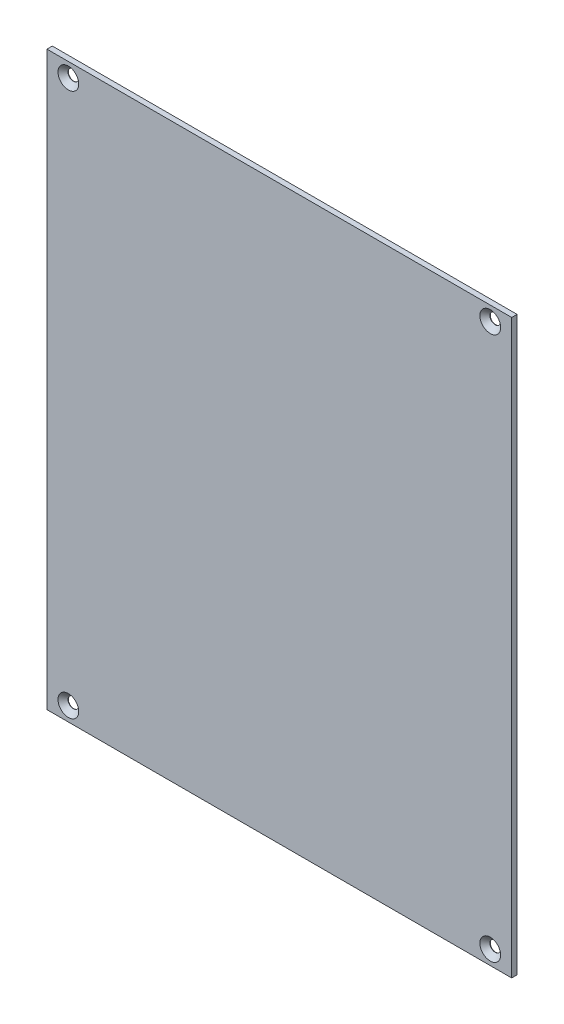
ISO-10303-21;
HEADER;
FILE_DESCRIPTION(('STEP AP214'),'2;1');
FILE_NAME('part.step','',(''),(''),'','','');
FILE_SCHEMA(('AUTOMOTIVE_DESIGN { 1 0 10303 214 1 1 1 1 }'));
ENDSEC;
DATA;
#1=APPLICATION_CONTEXT('core data for automotive mechanical design processes');
#2=APPLICATION_PROTOCOL_DEFINITION('international standard','automotive_design',2000,#1);
#3=PRODUCT_CONTEXT('',#1,'mechanical');
#4=PRODUCT('Part','Part','',(#3));
#5=PRODUCT_RELATED_PRODUCT_CATEGORY('part','',(#4));
#6=PRODUCT_DEFINITION_FORMATION('','',#4);
#7=PRODUCT_DEFINITION_CONTEXT('part definition',#1,'design');
#8=PRODUCT_DEFINITION('design','',#6,#7);
#9=PRODUCT_DEFINITION_SHAPE('','',#8);
#10=(LENGTH_UNIT() NAMED_UNIT(*) SI_UNIT(.MILLI.,.METRE.));
#11=(NAMED_UNIT(*) PLANE_ANGLE_UNIT() SI_UNIT($,.RADIAN.));
#12=(NAMED_UNIT(*) SI_UNIT($,.STERADIAN.) SOLID_ANGLE_UNIT());
#13=UNCERTAINTY_MEASURE_WITH_UNIT(LENGTH_MEASURE(1.E-05),#10,'distance_accuracy_value','');
#14=(GEOMETRIC_REPRESENTATION_CONTEXT(3) GLOBAL_UNCERTAINTY_ASSIGNED_CONTEXT((#13)) GLOBAL_UNIT_ASSIGNED_CONTEXT((#10,
#11,#12)) REPRESENTATION_CONTEXT('',''));
#15=CARTESIAN_POINT('',(0.,0.,0.));
#16=DIRECTION('',(0.,0.,1.));
#17=DIRECTION('',(1.,0.,0.));
#18=AXIS2_PLACEMENT_3D('',#15,#16,#17);
#19=CARTESIAN_POINT('',(0.,0.,0.));
#20=DIRECTION('',(0.,0.,1.));
#21=DIRECTION('',(1.,0.,0.));
#22=AXIS2_PLACEMENT_3D('',#19,#20,#21);
#23=PLANE('',#22);
#24=CARTESIAN_POINT('',(-59.,76.,0.));
#25=DIRECTION('',(0.,0.,-1.));
#26=DIRECTION('',(1.,0.,0.));
#27=AXIS2_PLACEMENT_3D('',#24,#25,#26);
#28=CIRCLE('',#27,1.5);
#29=CARTESIAN_POINT('',(-60.5,76.,0.));
#30=VERTEX_POINT('',#29);
#31=EDGE_CURVE('E202',#30,#30,#28,.T.);
#32=ORIENTED_EDGE('',*,*,#31,.F.);
#33=EDGE_LOOP('',(#32));
#34=FACE_BOUND('',#33,.T.);
#35=CARTESIAN_POINT('',(-59.,-76.,0.));
#36=DIRECTION('',(0.,0.,-1.));
#37=DIRECTION('',(1.,0.,0.));
#38=AXIS2_PLACEMENT_3D('',#35,#36,#37);
#39=CIRCLE('',#38,1.5);
#40=CARTESIAN_POINT('',(-60.5,-76.,0.));
#41=VERTEX_POINT('',#40);
#42=EDGE_CURVE('E181',#41,#41,#39,.T.);
#43=ORIENTED_EDGE('',*,*,#42,.F.);
#44=EDGE_LOOP('',(#43));
#45=FACE_BOUND('',#44,.T.);
#46=CARTESIAN_POINT('',(59.,-76.,0.));
#47=DIRECTION('',(0.,0.,-1.));
#48=DIRECTION('',(1.,0.,0.));
#49=AXIS2_PLACEMENT_3D('',#46,#47,#48);
#50=CIRCLE('',#49,1.5);
#51=CARTESIAN_POINT('',(57.5,-76.,0.));
#52=VERTEX_POINT('',#51);
#53=EDGE_CURVE('E215',#52,#52,#50,.T.);
#54=ORIENTED_EDGE('',*,*,#53,.F.);
#55=EDGE_LOOP('',(#54));
#56=FACE_BOUND('',#55,.T.);
#57=CARTESIAN_POINT('',(59.,76.,0.));
#58=DIRECTION('',(0.,0.,-1.));
#59=DIRECTION('',(1.,0.,0.));
#60=AXIS2_PLACEMENT_3D('',#57,#58,#59);
#61=CIRCLE('',#60,1.5);
#62=CARTESIAN_POINT('',(57.5,76.,0.));
#63=VERTEX_POINT('',#62);
#64=EDGE_CURVE('E198',#63,#63,#61,.T.);
#65=ORIENTED_EDGE('',*,*,#64,.F.);
#66=EDGE_LOOP('',(#65));
#67=FACE_BOUND('',#66,.T.);
#68=DIRECTION('',(0.,1.,0.));
#69=VECTOR('',#68,1.);
#70=CARTESIAN_POINT('',(65.,-80.,0.));
#71=LINE('',#70,#69);
#72=CARTESIAN_POINT('',(65.,-80.,0.));
#73=VERTEX_POINT('',#72);
#74=CARTESIAN_POINT('',(65.,80.,0.));
#75=VERTEX_POINT('',#74);
#76=EDGE_CURVE('E11',#73,#75,#71,.T.);
#77=ORIENTED_EDGE('',*,*,#76,.F.);
#78=DIRECTION('',(1.,0.,0.));
#79=VECTOR('',#78,1.);
#80=CARTESIAN_POINT('',(-65.,-80.,0.));
#81=LINE('',#80,#79);
#82=CARTESIAN_POINT('',(-65.,-80.,0.));
#83=VERTEX_POINT('',#82);
#84=EDGE_CURVE('E221',#83,#73,#81,.T.);
#85=ORIENTED_EDGE('',*,*,#84,.F.);
#86=DIRECTION('',(0.,-1.,0.));
#87=VECTOR('',#86,1.);
#88=CARTESIAN_POINT('',(-65.,80.,0.));
#89=LINE('',#88,#87);
#90=CARTESIAN_POINT('',(-65.,80.,0.));
#91=VERTEX_POINT('',#90);
#92=EDGE_CURVE('E128',#91,#83,#89,.T.);
#93=ORIENTED_EDGE('',*,*,#92,.F.);
#94=DIRECTION('',(-1.,0.,0.));
#95=VECTOR('',#94,1.);
#96=CARTESIAN_POINT('',(65.,80.,0.));
#97=LINE('',#96,#95);
#98=EDGE_CURVE('E170',#75,#91,#97,.T.);
#99=ORIENTED_EDGE('',*,*,#98,.F.);
#100=EDGE_LOOP('',(#77,#85,#93,#99));
#101=FACE_BOUND('',#100,.T.);
#102=ADVANCED_FACE('F16',(#34,#45,#56,#67,#101),#23,.F.);
#103=CARTESIAN_POINT('',(65.,-80.,0.));
#104=DIRECTION('',(1.,0.,0.));
#105=DIRECTION('',(0.,1.,0.));
#106=AXIS2_PLACEMENT_3D('',#103,#104,#105);
#107=PLANE('',#106);
#108=ORIENTED_EDGE('',*,*,#76,.T.);
#109=DIRECTION('',(0.,0.,1.));
#110=VECTOR('',#109,1.);
#111=CARTESIAN_POINT('',(65.,80.,0.));
#112=LINE('',#111,#110);
#113=CARTESIAN_POINT('',(65.,80.,1.5));
#114=VERTEX_POINT('',#113);
#115=EDGE_CURVE('E27',#75,#114,#112,.T.);
#116=ORIENTED_EDGE('',*,*,#115,.T.);
#117=DIRECTION('',(0.,1.,0.));
#118=VECTOR('',#117,1.);
#119=CARTESIAN_POINT('',(65.,-80.,1.5));
#120=LINE('',#119,#118);
#121=CARTESIAN_POINT('',(65.,-80.,1.5));
#122=VERTEX_POINT('',#121);
#123=EDGE_CURVE('E149',#122,#114,#120,.T.);
#124=ORIENTED_EDGE('',*,*,#123,.F.);
#125=DIRECTION('',(0.,0.,1.));
#126=VECTOR('',#125,1.);
#127=CARTESIAN_POINT('',(65.,-80.,0.));
#128=LINE('',#127,#126);
#129=EDGE_CURVE('E20',#73,#122,#128,.T.);
#130=ORIENTED_EDGE('',*,*,#129,.F.);
#131=EDGE_LOOP('',(#108,#116,#124,#130));
#132=FACE_BOUND('',#131,.T.);
#133=ADVANCED_FACE('F270',(#132),#107,.T.);
#134=CARTESIAN_POINT('',(65.,80.,0.));
#135=DIRECTION('',(0.,1.,0.));
#136=DIRECTION('',(1.,0.,0.));
#137=AXIS2_PLACEMENT_3D('',#134,#135,#136);
#138=PLANE('',#137);
#139=ORIENTED_EDGE('',*,*,#98,.T.);
#140=DIRECTION('',(0.,0.,1.));
#141=VECTOR('',#140,1.);
#142=CARTESIAN_POINT('',(-65.,80.,0.));
#143=LINE('',#142,#141);
#144=CARTESIAN_POINT('',(-65.,80.,1.5));
#145=VERTEX_POINT('',#144);
#146=EDGE_CURVE('E156',#91,#145,#143,.T.);
#147=ORIENTED_EDGE('',*,*,#146,.T.);
#148=DIRECTION('',(-1.,0.,0.));
#149=VECTOR('',#148,1.);
#150=CARTESIAN_POINT('',(65.,80.,1.5));
#151=LINE('',#150,#149);
#152=EDGE_CURVE('E142',#114,#145,#151,.T.);
#153=ORIENTED_EDGE('',*,*,#152,.F.);
#154=ORIENTED_EDGE('',*,*,#115,.F.);
#155=EDGE_LOOP('',(#139,#147,#153,#154));
#156=FACE_BOUND('',#155,.T.);
#157=ADVANCED_FACE('F278',(#156),#138,.T.);
#158=CARTESIAN_POINT('',(-65.,80.,0.));
#159=DIRECTION('',(-1.,0.,0.));
#160=DIRECTION('',(0.,0.,1.));
#161=AXIS2_PLACEMENT_3D('',#158,#159,#160);
#162=PLANE('',#161);
#163=ORIENTED_EDGE('',*,*,#92,.T.);
#164=DIRECTION('',(0.,0.,1.));
#165=VECTOR('',#164,1.);
#166=CARTESIAN_POINT('',(-65.,-80.,0.));
#167=LINE('',#166,#165);
#168=CARTESIAN_POINT('',(-65.,-80.,1.5));
#169=VERTEX_POINT('',#168);
#170=EDGE_CURVE('E121',#83,#169,#167,.T.);
#171=ORIENTED_EDGE('',*,*,#170,.T.);
#172=DIRECTION('',(0.,-1.,0.));
#173=VECTOR('',#172,1.);
#174=CARTESIAN_POINT('',(-65.,80.,1.5));
#175=LINE('',#174,#173);
#176=EDGE_CURVE('E125',#145,#169,#175,.T.);
#177=ORIENTED_EDGE('',*,*,#176,.F.);
#178=ORIENTED_EDGE('',*,*,#146,.F.);
#179=EDGE_LOOP('',(#163,#171,#177,#178));
#180=FACE_BOUND('',#179,.T.);
#181=ADVANCED_FACE('F122',(#180),#162,.T.);
#182=CARTESIAN_POINT('',(-65.,-80.,0.));
#183=DIRECTION('',(0.,-1.,0.));
#184=DIRECTION('',(0.,0.,-1.));
#185=AXIS2_PLACEMENT_3D('',#182,#183,#184);
#186=PLANE('',#185);
#187=ORIENTED_EDGE('',*,*,#84,.T.);
#188=ORIENTED_EDGE('',*,*,#129,.T.);
#189=DIRECTION('',(1.,0.,0.));
#190=VECTOR('',#189,1.);
#191=CARTESIAN_POINT('',(-65.,-80.,1.5));
#192=LINE('',#191,#190);
#193=EDGE_CURVE('E132',#169,#122,#192,.T.);
#194=ORIENTED_EDGE('',*,*,#193,.F.);
#195=ORIENTED_EDGE('',*,*,#170,.F.);
#196=EDGE_LOOP('',(#187,#188,#194,#195));
#197=FACE_BOUND('',#196,.T.);
#198=ADVANCED_FACE('F133',(#197),#186,.T.);
#199=CARTESIAN_POINT('',(-59.,76.,0.));
#200=DIRECTION('',(0.,0.,1.));
#201=DIRECTION('',(1.,0.,0.));
#202=AXIS2_PLACEMENT_3D('',#199,#200,#201);
#203=CYLINDRICAL_SURFACE('',#202,1.5);
#204=CARTESIAN_POINT('',(-59.,76.,0.1));
#205=DIRECTION('',(0.,0.,-1.));
#206=DIRECTION('',(1.,0.,0.));
#207=AXIS2_PLACEMENT_3D('',#204,#205,#206);
#208=CIRCLE('',#207,1.5);
#209=CARTESIAN_POINT('',(-60.5,76.,0.1));
#210=VERTEX_POINT('',#209);
#211=EDGE_CURVE('E157',#210,#210,#208,.T.);
#212=ORIENTED_EDGE('',*,*,#211,.F.);
#213=DIRECTION('',(0.,0.,-1.));
#214=VECTOR('',#213,1.);
#215=CARTESIAN_POINT('',(-60.5,76.,0.));
#216=LINE('',#215,#214);
#217=EDGE_CURVE('E161',#210,#30,#216,.T.);
#218=ORIENTED_EDGE('',*,*,#217,.T.);
#219=ORIENTED_EDGE('',*,*,#31,.T.);
#220=ORIENTED_EDGE('',*,*,#217,.F.);
#221=EDGE_LOOP('',(#212,#218,#219,#220));
#222=FACE_BOUND('',#221,.T.);
#223=ADVANCED_FACE('F289',(#222),#203,.F.);
#224=CARTESIAN_POINT('',(-59.,76.,0.8));
#225=DIRECTION('',(0.,0.,1.));
#226=DIRECTION('',(1.,0.,0.));
#227=AXIS2_PLACEMENT_3D('',#224,#225,#226);
#228=CONICAL_SURFACE('',#227,2.2,0.785398163397447);
#229=CARTESIAN_POINT('',(-59.,76.,1.5));
#230=DIRECTION('',(0.,0.,1.));
#231=DIRECTION('',(1.,0.,0.));
#232=AXIS2_PLACEMENT_3D('',#229,#230,#231);
#233=CIRCLE('',#232,2.9);
#234=CARTESIAN_POINT('',(-61.9,76.,1.5));
#235=VERTEX_POINT('',#234);
#236=EDGE_CURVE('E180',#235,#235,#233,.T.);
#237=ORIENTED_EDGE('',*,*,#236,.T.);
#238=DIRECTION('',(0.707106781186547,0.,-0.707106781186548));
#239=VECTOR('',#238,1.);
#240=CARTESIAN_POINT('',(-61.2,76.,0.8));
#241=LINE('',#240,#239);
#242=EDGE_CURVE('E152',#235,#210,#241,.T.);
#243=ORIENTED_EDGE('',*,*,#242,.T.);
#244=ORIENTED_EDGE('',*,*,#211,.T.);
#245=ORIENTED_EDGE('',*,*,#242,.F.);
#246=EDGE_LOOP('',(#237,#243,#244,#245));
#247=FACE_BOUND('',#246,.T.);
#248=ADVANCED_FACE('F251',(#247),#228,.F.);
#249=CARTESIAN_POINT('',(59.,76.,0.));
#250=DIRECTION('',(0.,0.,1.));
#251=DIRECTION('',(1.,0.,0.));
#252=AXIS2_PLACEMENT_3D('',#249,#250,#251);
#253=CYLINDRICAL_SURFACE('',#252,1.5);
#254=CARTESIAN_POINT('',(59.,76.,0.1));
#255=DIRECTION('',(0.,0.,-1.));
#256=DIRECTION('',(1.,0.,0.));
#257=AXIS2_PLACEMENT_3D('',#254,#255,#256);
#258=CIRCLE('',#257,1.5);
#259=CARTESIAN_POINT('',(57.5,76.,0.1));
#260=VERTEX_POINT('',#259);
#261=EDGE_CURVE('E162',#260,#260,#258,.T.);
#262=ORIENTED_EDGE('',*,*,#261,.F.);
#263=DIRECTION('',(0.,0.,-1.));
#264=VECTOR('',#263,1.);
#265=CARTESIAN_POINT('',(57.5,76.,0.));
#266=LINE('',#265,#264);
#267=EDGE_CURVE('E166',#260,#63,#266,.T.);
#268=ORIENTED_EDGE('',*,*,#267,.T.);
#269=ORIENTED_EDGE('',*,*,#64,.T.);
#270=ORIENTED_EDGE('',*,*,#267,.F.);
#271=EDGE_LOOP('',(#262,#268,#269,#270));
#272=FACE_BOUND('',#271,.T.);
#273=ADVANCED_FACE('F293',(#272),#253,.F.);
#274=CARTESIAN_POINT('',(59.,76.,0.8));
#275=DIRECTION('',(0.,0.,1.));
#276=DIRECTION('',(1.,0.,0.));
#277=AXIS2_PLACEMENT_3D('',#274,#275,#276);
#278=CONICAL_SURFACE('',#277,2.2,0.785398163397447);
#279=CARTESIAN_POINT('',(59.,76.,1.5));
#280=DIRECTION('',(0.,0.,1.));
#281=DIRECTION('',(1.,0.,0.));
#282=AXIS2_PLACEMENT_3D('',#279,#280,#281);
#283=CIRCLE('',#282,2.9);
#284=CARTESIAN_POINT('',(56.1,76.,1.5));
#285=VERTEX_POINT('',#284);
#286=EDGE_CURVE('E176',#285,#285,#283,.T.);
#287=ORIENTED_EDGE('',*,*,#286,.T.);
#288=DIRECTION('',(0.707106781186547,0.,-0.707106781186548));
#289=VECTOR('',#288,1.);
#290=CARTESIAN_POINT('',(56.8,76.,0.8));
#291=LINE('',#290,#289);
#292=EDGE_CURVE('E167',#285,#260,#291,.T.);
#293=ORIENTED_EDGE('',*,*,#292,.T.);
#294=ORIENTED_EDGE('',*,*,#261,.T.);
#295=ORIENTED_EDGE('',*,*,#292,.F.);
#296=EDGE_LOOP('',(#287,#293,#294,#295));
#297=FACE_BOUND('',#296,.T.);
#298=ADVANCED_FACE('F291',(#297),#278,.F.);
#299=CARTESIAN_POINT('',(-59.,-76.,0.));
#300=DIRECTION('',(0.,0.,1.));
#301=DIRECTION('',(1.,0.,0.));
#302=AXIS2_PLACEMENT_3D('',#299,#300,#301);
#303=CYLINDRICAL_SURFACE('',#302,1.5);
#304=CARTESIAN_POINT('',(-59.,-76.,0.1));
#305=DIRECTION('',(0.,0.,-1.));
#306=DIRECTION('',(1.,0.,0.));
#307=AXIS2_PLACEMENT_3D('',#304,#305,#306);
#308=CIRCLE('',#307,1.5);
#309=CARTESIAN_POINT('',(-60.5,-76.,0.1));
#310=VERTEX_POINT('',#309);
#311=EDGE_CURVE('E189',#310,#310,#308,.T.);
#312=ORIENTED_EDGE('',*,*,#311,.F.);
#313=DIRECTION('',(0.,0.,-1.));
#314=VECTOR('',#313,1.);
#315=CARTESIAN_POINT('',(-60.5,-76.,0.));
#316=LINE('',#315,#314);
#317=EDGE_CURVE('E185',#310,#41,#316,.T.);
#318=ORIENTED_EDGE('',*,*,#317,.T.);
#319=ORIENTED_EDGE('',*,*,#42,.T.);
#320=ORIENTED_EDGE('',*,*,#317,.F.);
#321=EDGE_LOOP('',(#312,#318,#319,#320));
#322=FACE_BOUND('',#321,.T.);
#323=ADVANCED_FACE('F265',(#322),#303,.F.);
#324=CARTESIAN_POINT('',(-59.,-76.,0.8));
#325=DIRECTION('',(0.,0.,1.));
#326=DIRECTION('',(1.,0.,0.));
#327=AXIS2_PLACEMENT_3D('',#324,#325,#326);
#328=CONICAL_SURFACE('',#327,2.2,0.785398163397447);
#329=CARTESIAN_POINT('',(-59.,-76.,1.5));
#330=DIRECTION('',(0.,0.,1.));
#331=DIRECTION('',(1.,0.,0.));
#332=AXIS2_PLACEMENT_3D('',#329,#330,#331);
#333=CIRCLE('',#332,2.9);
#334=CARTESIAN_POINT('',(-61.9,-76.,1.5));
#335=VERTEX_POINT('',#334);
#336=EDGE_CURVE('E138',#335,#335,#333,.T.);
#337=ORIENTED_EDGE('',*,*,#336,.T.);
#338=DIRECTION('',(0.707106781186547,0.,-0.707106781186548));
#339=VECTOR('',#338,1.);
#340=CARTESIAN_POINT('',(-61.2,-76.,0.8));
#341=LINE('',#340,#339);
#342=EDGE_CURVE('E212',#335,#310,#341,.T.);
#343=ORIENTED_EDGE('',*,*,#342,.T.);
#344=ORIENTED_EDGE('',*,*,#311,.T.);
#345=ORIENTED_EDGE('',*,*,#342,.F.);
#346=EDGE_LOOP('',(#337,#343,#344,#345));
#347=FACE_BOUND('',#346,.T.);
#348=ADVANCED_FACE('F18',(#347),#328,.F.);
#349=CARTESIAN_POINT('',(59.,-76.,0.));
#350=DIRECTION('',(0.,0.,1.));
#351=DIRECTION('',(1.,0.,0.));
#352=AXIS2_PLACEMENT_3D('',#349,#350,#351);
#353=CYLINDRICAL_SURFACE('',#352,1.5);
#354=CARTESIAN_POINT('',(59.,-76.,0.1));
#355=DIRECTION('',(0.,0.,-1.));
#356=DIRECTION('',(1.,0.,0.));
#357=AXIS2_PLACEMENT_3D('',#354,#355,#356);
#358=CIRCLE('',#357,1.5);
#359=CARTESIAN_POINT('',(57.5,-76.,0.1));
#360=VERTEX_POINT('',#359);
#361=EDGE_CURVE('E173',#360,#360,#358,.T.);
#362=ORIENTED_EDGE('',*,*,#361,.F.);
#363=DIRECTION('',(0.,0.,-1.));
#364=VECTOR('',#363,1.);
#365=CARTESIAN_POINT('',(57.5,-76.,0.));
#366=LINE('',#365,#364);
#367=EDGE_CURVE('E99',#360,#52,#366,.T.);
#368=ORIENTED_EDGE('',*,*,#367,.T.);
#369=ORIENTED_EDGE('',*,*,#53,.T.);
#370=ORIENTED_EDGE('',*,*,#367,.F.);
#371=EDGE_LOOP('',(#362,#368,#369,#370));
#372=FACE_BOUND('',#371,.T.);
#373=ADVANCED_FACE('F258',(#372),#353,.F.);
#374=CARTESIAN_POINT('',(0.,0.,1.5));
#375=DIRECTION('',(0.,0.,1.));
#376=DIRECTION('',(1.,0.,0.));
#377=AXIS2_PLACEMENT_3D('',#374,#375,#376);
#378=PLANE('',#377);
#379=CARTESIAN_POINT('',(59.,-76.,1.5));
#380=DIRECTION('',(0.,0.,1.));
#381=DIRECTION('',(1.,0.,0.));
#382=AXIS2_PLACEMENT_3D('',#379,#380,#381);
#383=CIRCLE('',#382,2.9);
#384=CARTESIAN_POINT('',(56.1,-76.,1.5));
#385=VERTEX_POINT('',#384);
#386=EDGE_CURVE('E190',#385,#385,#383,.T.);
#387=ORIENTED_EDGE('',*,*,#386,.F.);
#388=EDGE_LOOP('',(#387));
#389=FACE_BOUND('',#388,.T.);
#390=ORIENTED_EDGE('',*,*,#286,.F.);
#391=EDGE_LOOP('',(#390));
#392=FACE_BOUND('',#391,.T.);
#393=ORIENTED_EDGE('',*,*,#236,.F.);
#394=EDGE_LOOP('',(#393));
#395=FACE_BOUND('',#394,.T.);
#396=ORIENTED_EDGE('',*,*,#336,.F.);
#397=EDGE_LOOP('',(#396));
#398=FACE_BOUND('',#397,.T.);
#399=ORIENTED_EDGE('',*,*,#123,.T.);
#400=ORIENTED_EDGE('',*,*,#152,.T.);
#401=ORIENTED_EDGE('',*,*,#176,.T.);
#402=ORIENTED_EDGE('',*,*,#193,.T.);
#403=EDGE_LOOP('',(#399,#400,#401,#402));
#404=FACE_BOUND('',#403,.T.);
#405=ADVANCED_FACE('F140',(#389,#392,#395,#398,#404),#378,.T.);
#406=CARTESIAN_POINT('',(59.,-76.,0.8));
#407=DIRECTION('',(0.,0.,1.));
#408=DIRECTION('',(1.,0.,0.));
#409=AXIS2_PLACEMENT_3D('',#406,#407,#408);
#410=CONICAL_SURFACE('',#409,2.2,0.785398163397447);
#411=ORIENTED_EDGE('',*,*,#386,.T.);
#412=DIRECTION('',(0.707106781186547,0.,-0.707106781186548));
#413=VECTOR('',#412,1.);
#414=CARTESIAN_POINT('',(56.8,-76.,0.8));
#415=LINE('',#414,#413);
#416=EDGE_CURVE('E194',#385,#360,#415,.T.);
#417=ORIENTED_EDGE('',*,*,#416,.T.);
#418=ORIENTED_EDGE('',*,*,#361,.T.);
#419=ORIENTED_EDGE('',*,*,#416,.F.);
#420=EDGE_LOOP('',(#411,#417,#418,#419));
#421=FACE_BOUND('',#420,.T.);
#422=ADVANCED_FACE('F257',(#421),#410,.F.);
#423=CLOSED_SHELL('',(#102,#133,#157,#181,#198,#223,#248,#273,#298,#323,#348,#373,#405,#422));
#424=MANIFOLD_SOLID_BREP('B1',#423);
#425=ADVANCED_BREP_SHAPE_REPRESENTATION('',(#18,#424),#14);
#426=SHAPE_DEFINITION_REPRESENTATION(#9,#425);
ENDSEC;
END-ISO-10303-21;
